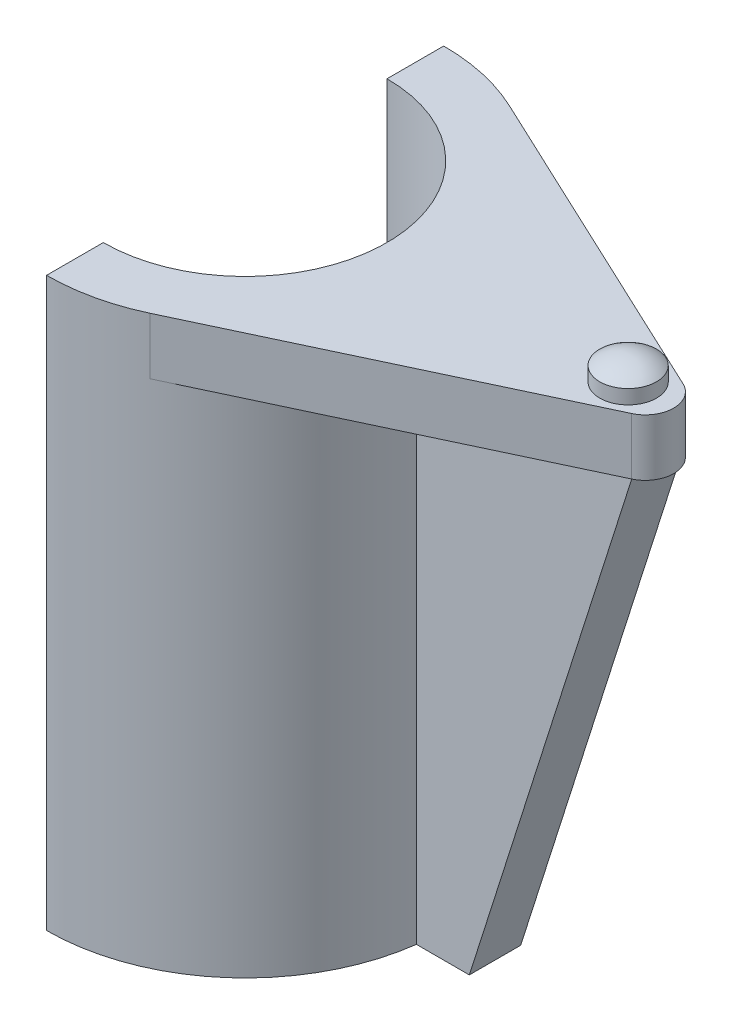
ISO-10303-21;
HEADER;
FILE_DESCRIPTION(('STEP AP214'),'2;1');
FILE_NAME('part.step','',(''),(''),'','','');
FILE_SCHEMA(('AUTOMOTIVE_DESIGN { 1 0 10303 214 1 1 1 1 }'));
ENDSEC;
DATA;
#1=APPLICATION_CONTEXT('core data for automotive mechanical design processes');
#2=APPLICATION_PROTOCOL_DEFINITION('international standard','automotive_design',2000,#1);
#3=PRODUCT_CONTEXT('',#1,'mechanical');
#4=PRODUCT('Part','Part','',(#3));
#5=PRODUCT_RELATED_PRODUCT_CATEGORY('part','',(#4));
#6=PRODUCT_DEFINITION_FORMATION('','',#4);
#7=PRODUCT_DEFINITION_CONTEXT('part definition',#1,'design');
#8=PRODUCT_DEFINITION('design','',#6,#7);
#9=PRODUCT_DEFINITION_SHAPE('','',#8);
#10=(LENGTH_UNIT() NAMED_UNIT(*) SI_UNIT(.MILLI.,.METRE.));
#11=(NAMED_UNIT(*) PLANE_ANGLE_UNIT() SI_UNIT($,.RADIAN.));
#12=(NAMED_UNIT(*) SI_UNIT($,.STERADIAN.) SOLID_ANGLE_UNIT());
#13=UNCERTAINTY_MEASURE_WITH_UNIT(LENGTH_MEASURE(1.E-05),#10,'distance_accuracy_value','');
#14=(GEOMETRIC_REPRESENTATION_CONTEXT(3) GLOBAL_UNCERTAINTY_ASSIGNED_CONTEXT((#13)) GLOBAL_UNIT_ASSIGNED_CONTEXT((#10,
#11,#12)) REPRESENTATION_CONTEXT('',''));
#15=CARTESIAN_POINT('',(0.,0.,0.));
#16=DIRECTION('',(0.,0.,1.));
#17=DIRECTION('',(1.,0.,0.));
#18=AXIS2_PLACEMENT_3D('',#15,#16,#17);
#19=CARTESIAN_POINT('',(0.,-400.,0.));
#20=DIRECTION('',(0.,1.,0.));
#21=DIRECTION('',(0.,0.,1.));
#22=AXIS2_PLACEMENT_3D('',#19,#20,#21);
#23=CYLINDRICAL_SURFACE('',#22,140.);
#24=DIRECTION('',(0.,1.,0.));
#25=VECTOR('',#24,1.);
#26=CARTESIAN_POINT('',(138.824954970404,-400.,18.100604339779));
#27=LINE('',#26,#25);
#28=CARTESIAN_POINT('',(138.824954970404,-40.,18.100604339779));
#29=VERTEX_POINT('',#28);
#30=CARTESIAN_POINT('',(138.824954970404,-400.,18.100604339779));
#31=VERTEX_POINT('',#30);
#32=EDGE_CURVE('E169',#29,#31,#27,.F.);
#33=ORIENTED_EDGE('',*,*,#32,.F.);
#34=CARTESIAN_POINT('',(0.,-40.,0.));
#35=DIRECTION('',(0.,1.,0.));
#36=DIRECTION('',(0.,0.,1.));
#37=AXIS2_PLACEMENT_3D('',#34,#35,#36);
#38=CIRCLE('',#37,140.);
#39=CARTESIAN_POINT('',(59.5486188270065,-40.,126.704230378452));
#40=VERTEX_POINT('',#39);
#41=EDGE_CURVE('E148',#29,#40,#38,.F.);
#42=ORIENTED_EDGE('',*,*,#41,.T.);
#43=DIRECTION('',(0.,1.,0.));
#44=VECTOR('',#43,1.);
#45=CARTESIAN_POINT('',(59.5486188270065,-40.,126.704230378452));
#46=LINE('',#45,#44);
#47=CARTESIAN_POINT('',(59.5486188270065,0.,126.704230378452));
#48=VERTEX_POINT('',#47);
#49=EDGE_CURVE('E158',#40,#48,#46,.T.);
#50=ORIENTED_EDGE('',*,*,#49,.T.);
#51=CARTESIAN_POINT('',(0.,0.,0.));
#52=DIRECTION('',(0.,1.,0.));
#53=DIRECTION('',(0.,0.,1.));
#54=AXIS2_PLACEMENT_3D('',#51,#52,#53);
#55=CIRCLE('',#54,140.);
#56=CARTESIAN_POINT('',(0.,0.,140.));
#57=VERTEX_POINT('',#56);
#58=EDGE_CURVE('E203',#57,#48,#55,.T.);
#59=ORIENTED_EDGE('',*,*,#58,.F.);
#60=DIRECTION('',(0.,1.,0.));
#61=VECTOR('',#60,1.);
#62=CARTESIAN_POINT('',(0.,-400.,140.));
#63=LINE('',#62,#61);
#64=CARTESIAN_POINT('',(0.,-400.,140.));
#65=VERTEX_POINT('',#64);
#66=EDGE_CURVE('E211',#65,#57,#63,.T.);
#67=ORIENTED_EDGE('',*,*,#66,.F.);
#68=CARTESIAN_POINT('',(0.,-400.,0.));
#69=DIRECTION('',(0.,1.,0.));
#70=DIRECTION('',(0.,0.,1.));
#71=AXIS2_PLACEMENT_3D('',#68,#69,#70);
#72=CIRCLE('',#71,140.);
#73=EDGE_CURVE('E190',#65,#31,#72,.T.);
#74=ORIENTED_EDGE('',*,*,#73,.T.);
#75=EDGE_LOOP('',(#33,#42,#50,#59,#67,#74));
#76=FACE_BOUND('',#75,.T.);
#77=ADVANCED_FACE('F34',(#76),#23,.T.);
#78=CARTESIAN_POINT('',(0.,-40.,0.));
#79=DIRECTION('',(0.,1.,0.));
#80=DIRECTION('',(0.,0.,1.));
#81=AXIS2_PLACEMENT_3D('',#78,#79,#80);
#82=PLANE('',#81);
#83=ORIENTED_EDGE('',*,*,#41,.F.);
#84=DIRECTION('',(1.,0.,0.));
#85=VECTOR('',#84,1.);
#86=CARTESIAN_POINT('',(0.,-40.,18.100604339779));
#87=LINE('',#86,#85);
#88=CARTESIAN_POINT('',(290.629357970844,-40.,18.100604339779));
#89=VERTEX_POINT('',#88);
#90=EDGE_CURVE('E42',#29,#89,#87,.T.);
#91=ORIENTED_EDGE('',*,*,#90,.T.);
#92=DIRECTION('',(0.905030216988944,0.,-0.425347277335761));
#93=VECTOR('',#92,1.);
#94=CARTESIAN_POINT('',(59.5486188270065,-40.,126.704230378452));
#95=LINE('',#94,#93);
#96=EDGE_CURVE('E147',#40,#89,#95,.T.);
#97=ORIENTED_EDGE('',*,*,#96,.F.);
#98=EDGE_LOOP('',(#83,#91,#97));
#99=FACE_BOUND('',#98,.T.);
#100=ADVANCED_FACE('F145',(#99),#82,.F.);
#101=CARTESIAN_POINT('',(0.,-400.,0.));
#102=DIRECTION('',(0.,1.,0.));
#103=DIRECTION('',(0.,0.,1.));
#104=AXIS2_PLACEMENT_3D('',#101,#102,#103);
#105=CYLINDRICAL_SURFACE('',#104,100.);
#106=CARTESIAN_POINT('',(0.,-400.,0.));
#107=DIRECTION('',(0.,-1.,0.));
#108=DIRECTION('',(0.,0.,1.));
#109=AXIS2_PLACEMENT_3D('',#106,#107,#108);
#110=CIRCLE('',#109,100.);
#111=CARTESIAN_POINT('',(0.,-400.,-100.));
#112=VERTEX_POINT('',#111);
#113=CARTESIAN_POINT('',(0.,-400.,100.));
#114=VERTEX_POINT('',#113);
#115=EDGE_CURVE('E183',#112,#114,#110,.T.);
#116=ORIENTED_EDGE('',*,*,#115,.T.);
#117=DIRECTION('',(0.,1.,0.));
#118=VECTOR('',#117,1.);
#119=CARTESIAN_POINT('',(0.,-400.,100.));
#120=LINE('',#119,#118);
#121=CARTESIAN_POINT('',(0.,0.,100.));
#122=VERTEX_POINT('',#121);
#123=EDGE_CURVE('E196',#114,#122,#120,.T.);
#124=ORIENTED_EDGE('',*,*,#123,.T.);
#125=CARTESIAN_POINT('',(0.,0.,0.));
#126=DIRECTION('',(0.,-1.,0.));
#127=DIRECTION('',(0.,0.,1.));
#128=AXIS2_PLACEMENT_3D('',#125,#126,#127);
#129=CIRCLE('',#128,100.);
#130=CARTESIAN_POINT('',(0.,0.,-100.));
#131=VERTEX_POINT('',#130);
#132=EDGE_CURVE('E182',#131,#122,#129,.T.);
#133=ORIENTED_EDGE('',*,*,#132,.F.);
#134=DIRECTION('',(0.,1.,0.));
#135=VECTOR('',#134,1.);
#136=CARTESIAN_POINT('',(0.,-400.,-100.));
#137=LINE('',#136,#135);
#138=EDGE_CURVE('E149',#112,#131,#137,.T.);
#139=ORIENTED_EDGE('',*,*,#138,.F.);
#140=EDGE_LOOP('',(#116,#124,#133,#139));
#141=FACE_BOUND('',#140,.T.);
#142=ADVANCED_FACE('F257',(#141),#105,.F.);
#143=CARTESIAN_POINT('',(0.,-400.,-140.));
#144=DIRECTION('',(-1.,0.,0.));
#145=DIRECTION('',(0.,0.,1.));
#146=AXIS2_PLACEMENT_3D('',#143,#144,#145);
#147=PLANE('',#146);
#148=CARTESIAN_POINT('',(0.,-350.,-120.));
#149=DIRECTION('',(-1.,0.,0.));
#150=DIRECTION('',(0.,0.,-1.));
#151=AXIS2_PLACEMENT_3D('',#148,#149,#150);
#152=CIRCLE('',#151,8.00000000000003);
#153=CARTESIAN_POINT('',(0.,-350.,-128.));
#154=VERTEX_POINT('',#153);
#155=EDGE_CURVE('E331',#154,#154,#152,.T.);
#156=ORIENTED_EDGE('',*,*,#155,.F.);
#157=EDGE_LOOP('',(#156));
#158=FACE_BOUND('',#157,.T.);
#159=CARTESIAN_POINT('',(0.,-290.,-120.));
#160=DIRECTION('',(-1.,0.,0.));
#161=DIRECTION('',(0.,0.,-1.));
#162=AXIS2_PLACEMENT_3D('',#159,#160,#161);
#163=CIRCLE('',#162,8.);
#164=CARTESIAN_POINT('',(0.,-290.,-128.));
#165=VERTEX_POINT('',#164);
#166=EDGE_CURVE('E337',#165,#165,#163,.T.);
#167=ORIENTED_EDGE('',*,*,#166,.F.);
#168=EDGE_LOOP('',(#167));
#169=FACE_BOUND('',#168,.T.);
#170=CARTESIAN_POINT('',(0.,-230.,-120.));
#171=DIRECTION('',(-1.,0.,0.));
#172=DIRECTION('',(0.,0.,-1.));
#173=AXIS2_PLACEMENT_3D('',#170,#171,#172);
#174=CIRCLE('',#173,8.);
#175=CARTESIAN_POINT('',(0.,-230.,-128.));
#176=VERTEX_POINT('',#175);
#177=EDGE_CURVE('E343',#176,#176,#174,.T.);
#178=ORIENTED_EDGE('',*,*,#177,.F.);
#179=EDGE_LOOP('',(#178));
#180=FACE_BOUND('',#179,.T.);
#181=CARTESIAN_POINT('',(0.,-170.,-120.));
#182=DIRECTION('',(-1.,0.,0.));
#183=DIRECTION('',(0.,0.,-1.));
#184=AXIS2_PLACEMENT_3D('',#181,#182,#183);
#185=CIRCLE('',#184,8.);
#186=CARTESIAN_POINT('',(0.,-170.,-128.));
#187=VERTEX_POINT('',#186);
#188=EDGE_CURVE('E349',#187,#187,#185,.T.);
#189=ORIENTED_EDGE('',*,*,#188,.F.);
#190=EDGE_LOOP('',(#189));
#191=FACE_BOUND('',#190,.T.);
#192=CARTESIAN_POINT('',(0.,-110.,-120.));
#193=DIRECTION('',(-1.,0.,0.));
#194=DIRECTION('',(0.,0.,-1.));
#195=AXIS2_PLACEMENT_3D('',#192,#193,#194);
#196=CIRCLE('',#195,8.00000000000003);
#197=CARTESIAN_POINT('',(0.,-110.,-128.));
#198=VERTEX_POINT('',#197);
#199=EDGE_CURVE('E355',#198,#198,#196,.T.);
#200=ORIENTED_EDGE('',*,*,#199,.F.);
#201=EDGE_LOOP('',(#200));
#202=FACE_BOUND('',#201,.T.);
#203=CARTESIAN_POINT('',(0.,-50.,-120.));
#204=DIRECTION('',(-1.,0.,0.));
#205=DIRECTION('',(0.,0.,-1.));
#206=AXIS2_PLACEMENT_3D('',#203,#204,#205);
#207=CIRCLE('',#206,7.99999999999998);
#208=CARTESIAN_POINT('',(0.,-50.,-128.));
#209=VERTEX_POINT('',#208);
#210=EDGE_CURVE('E128',#209,#209,#207,.T.);
#211=ORIENTED_EDGE('',*,*,#210,.F.);
#212=EDGE_LOOP('',(#211));
#213=FACE_BOUND('',#212,.T.);
#214=DIRECTION('',(0.,0.,1.));
#215=VECTOR('',#214,1.);
#216=CARTESIAN_POINT('',(0.,0.,-140.));
#217=LINE('',#216,#215);
#218=CARTESIAN_POINT('',(0.,0.,-140.));
#219=VERTEX_POINT('',#218);
#220=EDGE_CURVE('E186',#219,#131,#217,.T.);
#221=ORIENTED_EDGE('',*,*,#220,.F.);
#222=DIRECTION('',(0.,1.,0.));
#223=VECTOR('',#222,1.);
#224=CARTESIAN_POINT('',(0.,-400.,-140.));
#225=LINE('',#224,#223);
#226=CARTESIAN_POINT('',(0.,-400.,-140.));
#227=VERTEX_POINT('',#226);
#228=EDGE_CURVE('E209',#227,#219,#225,.T.);
#229=ORIENTED_EDGE('',*,*,#228,.F.);
#230=DIRECTION('',(0.,0.,1.));
#231=VECTOR('',#230,1.);
#232=CARTESIAN_POINT('',(0.,-400.,-140.));
#233=LINE('',#232,#231);
#234=EDGE_CURVE('E193',#227,#112,#233,.T.);
#235=ORIENTED_EDGE('',*,*,#234,.T.);
#236=ORIENTED_EDGE('',*,*,#138,.T.);
#237=EDGE_LOOP('',(#221,#229,#235,#236));
#238=FACE_BOUND('',#237,.T.);
#239=ADVANCED_FACE('F250',(#158,#169,#180,#191,#202,#213,#238),#147,.T.);
#240=DIRECTION('',(0.,1.,0.));
#241=VECTOR('',#240,1.);
#242=CARTESIAN_POINT('',(138.824954970404,-400.,-18.100604339779));
#243=LINE('',#242,#241);
#244=CARTESIAN_POINT('',(138.824954970404,-400.,-18.100604339779));
#245=VERTEX_POINT('',#244);
#246=CARTESIAN_POINT('',(138.824954970404,-40.,-18.100604339779));
#247=VERTEX_POINT('',#246);
#248=EDGE_CURVE('E49',#245,#247,#243,.T.);
#249=ORIENTED_EDGE('',*,*,#248,.F.);
#250=EDGE_CURVE('E189',#245,#227,#72,.T.);
#251=ORIENTED_EDGE('',*,*,#250,.T.);
#252=ORIENTED_EDGE('',*,*,#228,.T.);
#253=CARTESIAN_POINT('',(59.5486188270065,0.,-126.704230378452));
#254=VERTEX_POINT('',#253);
#255=EDGE_CURVE('E202',#254,#219,#55,.T.);
#256=ORIENTED_EDGE('',*,*,#255,.F.);
#257=DIRECTION('',(0.,1.,0.));
#258=VECTOR('',#257,1.);
#259=CARTESIAN_POINT('',(59.5486188270065,-40.,-126.704230378452));
#260=LINE('',#259,#258);
#261=CARTESIAN_POINT('',(59.5486188270065,-40.,-126.704230378452));
#262=VERTEX_POINT('',#261);
#263=EDGE_CURVE('E175',#262,#254,#260,.T.);
#264=ORIENTED_EDGE('',*,*,#263,.F.);
#265=EDGE_CURVE('E179',#262,#247,#38,.F.);
#266=ORIENTED_EDGE('',*,*,#265,.T.);
#267=EDGE_LOOP('',(#249,#251,#252,#256,#264,#266));
#268=FACE_BOUND('',#267,.T.);
#269=ADVANCED_FACE('F254',(#268),#23,.T.);
#270=CARTESIAN_POINT('',(0.,-400.,100.));
#271=DIRECTION('',(-1.,0.,0.));
#272=DIRECTION('',(0.,0.,1.));
#273=AXIS2_PLACEMENT_3D('',#270,#271,#272);
#274=PLANE('',#273);
#275=CARTESIAN_POINT('',(0.,-110.,120.));
#276=DIRECTION('',(-1.,0.,0.));
#277=DIRECTION('',(0.,0.,1.));
#278=AXIS2_PLACEMENT_3D('',#275,#276,#277);
#279=CIRCLE('',#278,8.00000000000003);
#280=CARTESIAN_POINT('',(0.,-110.,128.));
#281=VERTEX_POINT('',#280);
#282=EDGE_CURVE('E284',#281,#281,#279,.T.);
#283=ORIENTED_EDGE('',*,*,#282,.F.);
#284=EDGE_LOOP('',(#283));
#285=FACE_BOUND('',#284,.T.);
#286=CARTESIAN_POINT('',(0.,-170.,120.));
#287=DIRECTION('',(-1.,0.,0.));
#288=DIRECTION('',(0.,0.,1.));
#289=AXIS2_PLACEMENT_3D('',#286,#287,#288);
#290=CIRCLE('',#289,8.);
#291=CARTESIAN_POINT('',(0.,-170.,128.));
#292=VERTEX_POINT('',#291);
#293=EDGE_CURVE('E288',#292,#292,#290,.T.);
#294=ORIENTED_EDGE('',*,*,#293,.F.);
#295=EDGE_LOOP('',(#294));
#296=FACE_BOUND('',#295,.T.);
#297=CARTESIAN_POINT('',(0.,-230.,120.));
#298=DIRECTION('',(-1.,0.,0.));
#299=DIRECTION('',(0.,0.,1.));
#300=AXIS2_PLACEMENT_3D('',#297,#298,#299);
#301=CIRCLE('',#300,8.);
#302=CARTESIAN_POINT('',(0.,-230.,128.));
#303=VERTEX_POINT('',#302);
#304=EDGE_CURVE('E292',#303,#303,#301,.T.);
#305=ORIENTED_EDGE('',*,*,#304,.F.);
#306=EDGE_LOOP('',(#305));
#307=FACE_BOUND('',#306,.T.);
#308=CARTESIAN_POINT('',(0.,-290.,120.));
#309=DIRECTION('',(-1.,0.,0.));
#310=DIRECTION('',(0.,0.,1.));
#311=AXIS2_PLACEMENT_3D('',#308,#309,#310);
#312=CIRCLE('',#311,8.);
#313=CARTESIAN_POINT('',(0.,-290.,128.));
#314=VERTEX_POINT('',#313);
#315=EDGE_CURVE('E296',#314,#314,#312,.T.);
#316=ORIENTED_EDGE('',*,*,#315,.F.);
#317=EDGE_LOOP('',(#316));
#318=FACE_BOUND('',#317,.T.);
#319=CARTESIAN_POINT('',(0.,-350.,120.));
#320=DIRECTION('',(-1.,0.,0.));
#321=DIRECTION('',(0.,0.,1.));
#322=AXIS2_PLACEMENT_3D('',#319,#320,#321);
#323=CIRCLE('',#322,8.00000000000003);
#324=CARTESIAN_POINT('',(0.,-350.,128.));
#325=VERTEX_POINT('',#324);
#326=EDGE_CURVE('E300',#325,#325,#323,.T.);
#327=ORIENTED_EDGE('',*,*,#326,.F.);
#328=EDGE_LOOP('',(#327));
#329=FACE_BOUND('',#328,.T.);
#330=CARTESIAN_POINT('',(0.,-50.,120.));
#331=DIRECTION('',(-1.,0.,0.));
#332=DIRECTION('',(0.,0.,1.));
#333=AXIS2_PLACEMENT_3D('',#330,#331,#332);
#334=CIRCLE('',#333,7.99999999999998);
#335=CARTESIAN_POINT('',(0.,-50.,128.));
#336=VERTEX_POINT('',#335);
#337=EDGE_CURVE('E227',#336,#336,#334,.T.);
#338=ORIENTED_EDGE('',*,*,#337,.F.);
#339=EDGE_LOOP('',(#338));
#340=FACE_BOUND('',#339,.T.);
#341=DIRECTION('',(0.,0.,1.));
#342=VECTOR('',#341,1.);
#343=CARTESIAN_POINT('',(0.,0.,100.));
#344=LINE('',#343,#342);
#345=EDGE_CURVE('E199',#122,#57,#344,.T.);
#346=ORIENTED_EDGE('',*,*,#345,.F.);
#347=ORIENTED_EDGE('',*,*,#123,.F.);
#348=DIRECTION('',(0.,0.,1.));
#349=VECTOR('',#348,1.);
#350=CARTESIAN_POINT('',(0.,-400.,100.));
#351=LINE('',#350,#349);
#352=EDGE_CURVE('E185',#114,#65,#351,.T.);
#353=ORIENTED_EDGE('',*,*,#352,.T.);
#354=ORIENTED_EDGE('',*,*,#66,.T.);
#355=EDGE_LOOP('',(#346,#347,#353,#354));
#356=FACE_BOUND('',#355,.T.);
#357=ADVANCED_FACE('F241',(#285,#296,#307,#318,#329,#340,#356),#274,.T.);
#358=CARTESIAN_POINT('',(0.,-400.,0.));
#359=DIRECTION('',(0.,1.,0.));
#360=DIRECTION('',(0.,0.,1.));
#361=AXIS2_PLACEMENT_3D('',#358,#359,#360);
#362=PLANE('',#361);
#363=DIRECTION('',(-1.,0.,0.));
#364=VECTOR('',#363,1.);
#365=CARTESIAN_POINT('',(290.629357970844,-400.,-18.100604339779));
#366=LINE('',#365,#364);
#367=CARTESIAN_POINT('',(176.145834141605,-400.,-18.1006043397791));
#368=VERTEX_POINT('',#367);
#369=EDGE_CURVE('E219',#368,#245,#366,.T.);
#370=ORIENTED_EDGE('',*,*,#369,.F.);
#371=DIRECTION('',(0.,0.,1.));
#372=VECTOR('',#371,1.);
#373=CARTESIAN_POINT('',(176.145834141605,-400.,-151.899395660221));
#374=LINE('',#373,#372);
#375=CARTESIAN_POINT('',(176.145834141605,-400.,18.100604339779));
#376=VERTEX_POINT('',#375);
#377=EDGE_CURVE('E137',#368,#376,#374,.T.);
#378=ORIENTED_EDGE('',*,*,#377,.T.);
#379=DIRECTION('',(1.,0.,0.));
#380=VECTOR('',#379,1.);
#381=CARTESIAN_POINT('',(290.629357970844,-400.,18.1006043397791));
#382=LINE('',#381,#380);
#383=EDGE_CURVE('E136',#31,#376,#382,.T.);
#384=ORIENTED_EDGE('',*,*,#383,.F.);
#385=ORIENTED_EDGE('',*,*,#73,.F.);
#386=ORIENTED_EDGE('',*,*,#352,.F.);
#387=ORIENTED_EDGE('',*,*,#115,.F.);
#388=ORIENTED_EDGE('',*,*,#234,.F.);
#389=ORIENTED_EDGE('',*,*,#250,.F.);
#390=EDGE_LOOP('',(#370,#378,#384,#385,#386,#387,#388,#389));
#391=FACE_BOUND('',#390,.T.);
#392=ADVANCED_FACE('F236',(#391),#362,.F.);
#393=CARTESIAN_POINT('',(0.,0.,0.));
#394=DIRECTION('',(0.,1.,0.));
#395=DIRECTION('',(0.,0.,1.));
#396=AXIS2_PLACEMENT_3D('',#393,#394,#395);
#397=PLANE('',#396);
#398=CARTESIAN_POINT('',(270.,0.,0.));
#399=DIRECTION('',(0.,1.,0.));
#400=DIRECTION('',(0.,0.,1.));
#401=AXIS2_PLACEMENT_3D('',#398,#399,#400);
#402=CIRCLE('',#401,20.);
#403=CARTESIAN_POINT('',(270.,0.,20.));
#404=VERTEX_POINT('',#403);
#405=EDGE_CURVE('E216',#404,#404,#402,.T.);
#406=ORIENTED_EDGE('',*,*,#405,.F.);
#407=EDGE_LOOP('',(#406));
#408=FACE_BOUND('',#407,.T.);
#409=ORIENTED_EDGE('',*,*,#132,.T.);
#410=ORIENTED_EDGE('',*,*,#345,.T.);
#411=ORIENTED_EDGE('',*,*,#58,.T.);
#412=DIRECTION('',(0.905030216988944,0.,-0.425347277335761));
#413=VECTOR('',#412,1.);
#414=CARTESIAN_POINT('',(59.5486188270065,0.,126.704230378452));
#415=LINE('',#414,#413);
#416=CARTESIAN_POINT('',(290.629357970844,0.,18.100604339779));
#417=VERTEX_POINT('',#416);
#418=EDGE_CURVE('E172',#48,#417,#415,.T.);
#419=ORIENTED_EDGE('',*,*,#418,.T.);
#420=CARTESIAN_POINT('',(282.122412424129,0.,0.));
#421=DIRECTION('',(0.,1.,0.));
#422=DIRECTION('',(0.,0.,1.));
#423=AXIS2_PLACEMENT_3D('',#420,#421,#422);
#424=CIRCLE('',#423,20.);
#425=CARTESIAN_POINT('',(290.629357970844,0.,-18.100604339779));
#426=VERTEX_POINT('',#425);
#427=EDGE_CURVE('E154',#417,#426,#424,.T.);
#428=ORIENTED_EDGE('',*,*,#427,.T.);
#429=DIRECTION('',(-0.905030216988944,0.,-0.425347277335761));
#430=VECTOR('',#429,1.);
#431=CARTESIAN_POINT('',(59.5486188270065,0.,-126.704230378452));
#432=LINE('',#431,#430);
#433=EDGE_CURVE('E57',#426,#254,#432,.T.);
#434=ORIENTED_EDGE('',*,*,#433,.T.);
#435=ORIENTED_EDGE('',*,*,#255,.T.);
#436=ORIENTED_EDGE('',*,*,#220,.T.);
#437=EDGE_LOOP('',(#409,#410,#411,#419,#428,#434,#435,#436));
#438=FACE_BOUND('',#437,.T.);
#439=ADVANCED_FACE('F256',(#408,#438),#397,.T.);
#440=CARTESIAN_POINT('',(59.5486188270065,-40.,-126.704230378452));
#441=DIRECTION('',(0.425347277335761,0.,-0.905030216988944));
#442=DIRECTION('',(-0.905030216988944,0.,-0.425347277335761));
#443=AXIS2_PLACEMENT_3D('',#440,#441,#442);
#444=PLANE('',#443);
#445=ORIENTED_EDGE('',*,*,#433,.F.);
#446=DIRECTION('',(0.,1.,0.));
#447=VECTOR('',#446,1.);
#448=CARTESIAN_POINT('',(290.629357970844,-40.,-18.100604339779));
#449=LINE('',#448,#447);
#450=CARTESIAN_POINT('',(290.629357970844,-40.,-18.1006043397791));
#451=VERTEX_POINT('',#450);
#452=EDGE_CURVE('E157',#451,#426,#449,.T.);
#453=ORIENTED_EDGE('',*,*,#452,.F.);
#454=DIRECTION('',(-0.905030216988944,0.,-0.425347277335761));
#455=VECTOR('',#454,1.);
#456=CARTESIAN_POINT('',(59.5486188270065,-40.,-126.704230378452));
#457=LINE('',#456,#455);
#458=EDGE_CURVE('E163',#451,#262,#457,.T.);
#459=ORIENTED_EDGE('',*,*,#458,.T.);
#460=ORIENTED_EDGE('',*,*,#263,.T.);
#461=EDGE_LOOP('',(#445,#453,#459,#460));
#462=FACE_BOUND('',#461,.T.);
#463=ADVANCED_FACE('F403',(#462),#444,.T.);
#464=CARTESIAN_POINT('',(282.122412424129,-40.,0.));
#465=DIRECTION('',(0.,1.,0.));
#466=DIRECTION('',(0.,0.,1.));
#467=AXIS2_PLACEMENT_3D('',#464,#465,#466);
#468=CYLINDRICAL_SURFACE('',#467,20.);
#469=CARTESIAN_POINT('',(282.122412424129,-40.,0.));
#470=DIRECTION('',(0.,1.,0.));
#471=DIRECTION('',(-1.,0.,0.));
#472=AXIS2_PLACEMENT_3D('',#469,#470,#471);
#473=CIRCLE('',#472,20.);
#474=EDGE_CURVE('E11',#451,#89,#473,.F.);
#475=ORIENTED_EDGE('',*,*,#474,.F.);
#476=ORIENTED_EDGE('',*,*,#452,.T.);
#477=ORIENTED_EDGE('',*,*,#427,.F.);
#478=DIRECTION('',(0.,1.,0.));
#479=VECTOR('',#478,1.);
#480=CARTESIAN_POINT('',(290.629357970844,-40.,18.100604339779));
#481=LINE('',#480,#479);
#482=EDGE_CURVE('E152',#89,#417,#481,.T.);
#483=ORIENTED_EDGE('',*,*,#482,.F.);
#484=EDGE_LOOP('',(#475,#476,#477,#483));
#485=FACE_BOUND('',#484,.T.);
#486=ADVANCED_FACE('F153',(#485),#468,.T.);
#487=CARTESIAN_POINT('',(59.5486188270065,-40.,126.704230378452));
#488=DIRECTION('',(0.425347277335761,0.,0.905030216988944));
#489=DIRECTION('',(0.905030216988944,0.,-0.425347277335761));
#490=AXIS2_PLACEMENT_3D('',#487,#488,#489);
#491=PLANE('',#490);
#492=ORIENTED_EDGE('',*,*,#418,.F.);
#493=ORIENTED_EDGE('',*,*,#49,.F.);
#494=ORIENTED_EDGE('',*,*,#96,.T.);
#495=ORIENTED_EDGE('',*,*,#482,.T.);
#496=EDGE_LOOP('',(#492,#493,#494,#495));
#497=FACE_BOUND('',#496,.T.);
#498=ADVANCED_FACE('F161',(#497),#491,.T.);
#499=ORIENTED_EDGE('',*,*,#458,.F.);
#500=DIRECTION('',(-1.,0.,0.));
#501=VECTOR('',#500,1.);
#502=CARTESIAN_POINT('',(290.629357970844,-40.,-18.100604339779));
#503=LINE('',#502,#501);
#504=EDGE_CURVE('E215',#451,#247,#503,.T.);
#505=ORIENTED_EDGE('',*,*,#504,.T.);
#506=ORIENTED_EDGE('',*,*,#265,.F.);
#507=EDGE_LOOP('',(#499,#505,#506));
#508=FACE_BOUND('',#507,.T.);
#509=ADVANCED_FACE('F266',(#508),#82,.F.);
#510=CARTESIAN_POINT('',(290.629357970844,-400.,18.1006043397791));
#511=DIRECTION('',(0.,0.,1.));
#512=DIRECTION('',(1.,0.,0.));
#513=AXIS2_PLACEMENT_3D('',#510,#511,#512);
#514=PLANE('',#513);
#515=DIRECTION('',(-0.303054785214158,-0.952973135591345,0.));
#516=VECTOR('',#515,1.);
#517=CARTESIAN_POINT('',(290.629357970844,-40.,18.100604339779));
#518=LINE('',#517,#516);
#519=EDGE_CURVE('E122',#89,#376,#518,.T.);
#520=ORIENTED_EDGE('',*,*,#519,.F.);
#521=ORIENTED_EDGE('',*,*,#90,.F.);
#522=ORIENTED_EDGE('',*,*,#32,.T.);
#523=ORIENTED_EDGE('',*,*,#383,.T.);
#524=EDGE_LOOP('',(#520,#521,#522,#523));
#525=FACE_BOUND('',#524,.T.);
#526=ADVANCED_FACE('F132',(#525),#514,.T.);
#527=CARTESIAN_POINT('',(290.629357970844,-400.,-18.100604339779));
#528=DIRECTION('',(0.,0.,-1.));
#529=DIRECTION('',(-1.,0.,0.));
#530=AXIS2_PLACEMENT_3D('',#527,#528,#529);
#531=PLANE('',#530);
#532=DIRECTION('',(0.303054785214158,0.952973135591345,0.));
#533=VECTOR('',#532,1.);
#534=CARTESIAN_POINT('',(186.660253159105,-366.936806977168,-18.100604339779));
#535=LINE('',#534,#533);
#536=EDGE_CURVE('E125',#368,#451,#535,.T.);
#537=ORIENTED_EDGE('',*,*,#536,.F.);
#538=ORIENTED_EDGE('',*,*,#369,.T.);
#539=ORIENTED_EDGE('',*,*,#248,.T.);
#540=ORIENTED_EDGE('',*,*,#504,.F.);
#541=EDGE_LOOP('',(#537,#538,#539,#540));
#542=FACE_BOUND('',#541,.T.);
#543=ADVANCED_FACE('F395',(#542),#531,.T.);
#544=CARTESIAN_POINT('',(270.,10.,0.));
#545=DIRECTION('',(0.,-1.,0.));
#546=DIRECTION('',(0.,0.,-1.));
#547=AXIS2_PLACEMENT_3D('',#544,#545,#546);
#548=CYLINDRICAL_SURFACE('',#547,20.);
#549=CARTESIAN_POINT('',(270.,10.,0.));
#550=DIRECTION('',(0.,1.,0.));
#551=DIRECTION('',(0.,0.,1.));
#552=AXIS2_PLACEMENT_3D('',#549,#550,#551);
#553=CIRCLE('',#552,20.);
#554=CARTESIAN_POINT('',(270.,10.,20.));
#555=VERTEX_POINT('',#554);
#556=EDGE_CURVE('E213',#555,#555,#553,.T.);
#557=ORIENTED_EDGE('',*,*,#556,.F.);
#558=EDGE_LOOP('',(#557));
#559=FACE_BOUND('',#558,.T.);
#560=ORIENTED_EDGE('',*,*,#405,.T.);
#561=EDGE_LOOP('',(#560));
#562=FACE_BOUND('',#561,.T.);
#563=ADVANCED_FACE('F392',(#559,#562),#548,.T.);
#564=CARTESIAN_POINT('',(270.,-15.0714285714286,0.));
#565=DIRECTION('',(0.,0.,1.));
#566=DIRECTION('',(1.,0.,0.));
#567=AXIS2_PLACEMENT_3D('',#564,#565,#566);
#568=SPHERICAL_SURFACE('',#567,32.0714285714286);
#569=CARTESIAN_POINT('',(270.,-15.0714285714286,0.));
#570=DIRECTION('',(0.,1.,0.));
#571=DIRECTION('',(0.,0.,1.));
#572=AXIS2_PLACEMENT_3D('',#569,#570,#571);
#573=SPHERICAL_SURFACE('',#572,32.0714285714286);
#574=ORIENTED_EDGE('',*,*,#556,.T.);
#575=EDGE_LOOP('',(#574));
#576=FACE_BOUND('',#575,.T.);
#577=ADVANCED_FACE('F36',(#576),#573,.T.);
#578=CARTESIAN_POINT('',(50.,-50.,120.));
#579=DIRECTION('',(-1.,0.,0.));
#580=DIRECTION('',(0.,0.,1.));
#581=AXIS2_PLACEMENT_3D('',#578,#579,#580);
#582=CYLINDRICAL_SURFACE('',#581,7.99999999999998);
#583=CARTESIAN_POINT('',(50.,-50.,120.));
#584=DIRECTION('',(-1.,0.,0.));
#585=DIRECTION('',(0.,0.,1.));
#586=AXIS2_PLACEMENT_3D('',#583,#584,#585);
#587=CIRCLE('',#586,7.99999999999998);
#588=CARTESIAN_POINT('',(50.,-50.,128.));
#589=VERTEX_POINT('',#588);
#590=EDGE_CURVE('E222',#589,#589,#587,.T.);
#591=ORIENTED_EDGE('',*,*,#590,.F.);
#592=EDGE_LOOP('',(#591));
#593=FACE_BOUND('',#592,.T.);
#594=ORIENTED_EDGE('',*,*,#337,.T.);
#595=EDGE_LOOP('',(#594));
#596=FACE_BOUND('',#595,.T.);
#597=ADVANCED_FACE('F387',(#593,#596),#582,.F.);
#598=CARTESIAN_POINT('',(50.,-50.,120.));
#599=DIRECTION('',(-1.,0.,0.));
#600=DIRECTION('',(0.,0.,1.));
#601=AXIS2_PLACEMENT_3D('',#598,#599,#600);
#602=PLANE('',#601);
#603=ORIENTED_EDGE('',*,*,#590,.T.);
#604=EDGE_LOOP('',(#603));
#605=FACE_BOUND('',#604,.T.);
#606=ADVANCED_FACE('F383',(#605),#602,.T.);
#607=CARTESIAN_POINT('',(50.,-350.,120.));
#608=DIRECTION('',(-1.,0.,0.));
#609=DIRECTION('',(0.,0.,1.));
#610=AXIS2_PLACEMENT_3D('',#607,#608,#609);
#611=CYLINDRICAL_SURFACE('',#610,8.00000000000003);
#612=CARTESIAN_POINT('',(50.,-350.,120.));
#613=DIRECTION('',(-1.,0.,0.));
#614=DIRECTION('',(0.,0.,1.));
#615=AXIS2_PLACEMENT_3D('',#612,#613,#614);
#616=CIRCLE('',#615,8.00000000000003);
#617=CARTESIAN_POINT('',(50.,-350.,128.));
#618=VERTEX_POINT('',#617);
#619=EDGE_CURVE('E324',#618,#618,#616,.T.);
#620=ORIENTED_EDGE('',*,*,#619,.F.);
#621=EDGE_LOOP('',(#620));
#622=FACE_BOUND('',#621,.T.);
#623=ORIENTED_EDGE('',*,*,#326,.T.);
#624=EDGE_LOOP('',(#623));
#625=FACE_BOUND('',#624,.T.);
#626=ADVANCED_FACE('F386',(#622,#625),#611,.F.);
#627=CARTESIAN_POINT('',(50.,-350.,120.));
#628=DIRECTION('',(-1.,0.,0.));
#629=DIRECTION('',(0.,0.,1.));
#630=AXIS2_PLACEMENT_3D('',#627,#628,#629);
#631=PLANE('',#630);
#632=ORIENTED_EDGE('',*,*,#619,.T.);
#633=EDGE_LOOP('',(#632));
#634=FACE_BOUND('',#633,.T.);
#635=ADVANCED_FACE('F465',(#634),#631,.T.);
#636=CARTESIAN_POINT('',(50.,-290.,120.));
#637=DIRECTION('',(-1.,0.,0.));
#638=DIRECTION('',(0.,0.,1.));
#639=AXIS2_PLACEMENT_3D('',#636,#637,#638);
#640=CYLINDRICAL_SURFACE('',#639,8.);
#641=CARTESIAN_POINT('',(50.,-290.,120.));
#642=DIRECTION('',(-1.,0.,0.));
#643=DIRECTION('',(0.,0.,1.));
#644=AXIS2_PLACEMENT_3D('',#641,#642,#643);
#645=CIRCLE('',#644,8.);
#646=CARTESIAN_POINT('',(50.,-290.,128.));
#647=VERTEX_POINT('',#646);
#648=EDGE_CURVE('E320',#647,#647,#645,.T.);
#649=ORIENTED_EDGE('',*,*,#648,.F.);
#650=EDGE_LOOP('',(#649));
#651=FACE_BOUND('',#650,.T.);
#652=ORIENTED_EDGE('',*,*,#315,.T.);
#653=EDGE_LOOP('',(#652));
#654=FACE_BOUND('',#653,.T.);
#655=ADVANCED_FACE('F473',(#651,#654),#640,.F.);
#656=CARTESIAN_POINT('',(50.,-290.,120.));
#657=DIRECTION('',(-1.,0.,0.));
#658=DIRECTION('',(0.,0.,1.));
#659=AXIS2_PLACEMENT_3D('',#656,#657,#658);
#660=PLANE('',#659);
#661=ORIENTED_EDGE('',*,*,#648,.T.);
#662=EDGE_LOOP('',(#661));
#663=FACE_BOUND('',#662,.T.);
#664=ADVANCED_FACE('F481',(#663),#660,.T.);
#665=CARTESIAN_POINT('',(50.,-230.,120.));
#666=DIRECTION('',(-1.,0.,0.));
#667=DIRECTION('',(0.,0.,1.));
#668=AXIS2_PLACEMENT_3D('',#665,#666,#667);
#669=CYLINDRICAL_SURFACE('',#668,8.);
#670=CARTESIAN_POINT('',(50.,-230.,120.));
#671=DIRECTION('',(-1.,0.,0.));
#672=DIRECTION('',(0.,0.,1.));
#673=AXIS2_PLACEMENT_3D('',#670,#671,#672);
#674=CIRCLE('',#673,8.);
#675=CARTESIAN_POINT('',(50.,-230.,128.));
#676=VERTEX_POINT('',#675);
#677=EDGE_CURVE('E316',#676,#676,#674,.T.);
#678=ORIENTED_EDGE('',*,*,#677,.F.);
#679=EDGE_LOOP('',(#678));
#680=FACE_BOUND('',#679,.T.);
#681=ORIENTED_EDGE('',*,*,#304,.T.);
#682=EDGE_LOOP('',(#681));
#683=FACE_BOUND('',#682,.T.);
#684=ADVANCED_FACE('F489',(#680,#683),#669,.F.);
#685=CARTESIAN_POINT('',(50.,-230.,120.));
#686=DIRECTION('',(-1.,0.,0.));
#687=DIRECTION('',(0.,0.,1.));
#688=AXIS2_PLACEMENT_3D('',#685,#686,#687);
#689=PLANE('',#688);
#690=ORIENTED_EDGE('',*,*,#677,.T.);
#691=EDGE_LOOP('',(#690));
#692=FACE_BOUND('',#691,.T.);
#693=ADVANCED_FACE('F497',(#692),#689,.T.);
#694=CARTESIAN_POINT('',(50.,-170.,120.));
#695=DIRECTION('',(-1.,0.,0.));
#696=DIRECTION('',(0.,0.,1.));
#697=AXIS2_PLACEMENT_3D('',#694,#695,#696);
#698=CYLINDRICAL_SURFACE('',#697,8.);
#699=CARTESIAN_POINT('',(50.,-170.,120.));
#700=DIRECTION('',(-1.,0.,0.));
#701=DIRECTION('',(0.,0.,1.));
#702=AXIS2_PLACEMENT_3D('',#699,#700,#701);
#703=CIRCLE('',#702,8.);
#704=CARTESIAN_POINT('',(50.,-170.,128.));
#705=VERTEX_POINT('',#704);
#706=EDGE_CURVE('E309',#705,#705,#703,.T.);
#707=ORIENTED_EDGE('',*,*,#706,.F.);
#708=EDGE_LOOP('',(#707));
#709=FACE_BOUND('',#708,.T.);
#710=ORIENTED_EDGE('',*,*,#293,.T.);
#711=EDGE_LOOP('',(#710));
#712=FACE_BOUND('',#711,.T.);
#713=ADVANCED_FACE('F505',(#709,#712),#698,.F.);
#714=CARTESIAN_POINT('',(50.,-170.,120.));
#715=DIRECTION('',(-1.,0.,0.));
#716=DIRECTION('',(0.,0.,1.));
#717=AXIS2_PLACEMENT_3D('',#714,#715,#716);
#718=PLANE('',#717);
#719=ORIENTED_EDGE('',*,*,#706,.T.);
#720=EDGE_LOOP('',(#719));
#721=FACE_BOUND('',#720,.T.);
#722=ADVANCED_FACE('F513',(#721),#718,.T.);
#723=CARTESIAN_POINT('',(50.,-110.,120.));
#724=DIRECTION('',(-1.,0.,0.));
#725=DIRECTION('',(0.,0.,1.));
#726=AXIS2_PLACEMENT_3D('',#723,#724,#725);
#727=CYLINDRICAL_SURFACE('',#726,8.00000000000003);
#728=CARTESIAN_POINT('',(50.,-110.,120.));
#729=DIRECTION('',(-1.,0.,0.));
#730=DIRECTION('',(0.,0.,1.));
#731=AXIS2_PLACEMENT_3D('',#728,#729,#730);
#732=CIRCLE('',#731,8.00000000000003);
#733=CARTESIAN_POINT('',(50.,-110.,128.));
#734=VERTEX_POINT('',#733);
#735=EDGE_CURVE('E304',#734,#734,#732,.T.);
#736=ORIENTED_EDGE('',*,*,#735,.F.);
#737=EDGE_LOOP('',(#736));
#738=FACE_BOUND('',#737,.T.);
#739=ORIENTED_EDGE('',*,*,#282,.T.);
#740=EDGE_LOOP('',(#739));
#741=FACE_BOUND('',#740,.T.);
#742=ADVANCED_FACE('F378',(#738,#741),#727,.F.);
#743=CARTESIAN_POINT('',(50.,-110.,120.));
#744=DIRECTION('',(-1.,0.,0.));
#745=DIRECTION('',(0.,0.,1.));
#746=AXIS2_PLACEMENT_3D('',#743,#744,#745);
#747=PLANE('',#746);
#748=ORIENTED_EDGE('',*,*,#735,.T.);
#749=EDGE_LOOP('',(#748));
#750=FACE_BOUND('',#749,.T.);
#751=ADVANCED_FACE('F368',(#750),#747,.T.);
#752=CARTESIAN_POINT('',(50.,-50.,-120.));
#753=DIRECTION('',(-1.,0.,0.));
#754=DIRECTION('',(0.,0.,1.));
#755=AXIS2_PLACEMENT_3D('',#752,#753,#754);
#756=CYLINDRICAL_SURFACE('',#755,7.99999999999998);
#757=CARTESIAN_POINT('',(50.,-50.,-120.));
#758=DIRECTION('',(-1.,0.,0.));
#759=DIRECTION('',(0.,0.,-1.));
#760=AXIS2_PLACEMENT_3D('',#757,#758,#759);
#761=CIRCLE('',#760,7.99999999999998);
#762=CARTESIAN_POINT('',(50.,-50.,-128.));
#763=VERTEX_POINT('',#762);
#764=EDGE_CURVE('E358',#763,#763,#761,.T.);
#765=ORIENTED_EDGE('',*,*,#764,.F.);
#766=EDGE_LOOP('',(#765));
#767=FACE_BOUND('',#766,.T.);
#768=ORIENTED_EDGE('',*,*,#210,.T.);
#769=EDGE_LOOP('',(#768));
#770=FACE_BOUND('',#769,.T.);
#771=ADVANCED_FACE('F364',(#767,#770),#756,.F.);
#772=CARTESIAN_POINT('',(50.,-50.,-120.));
#773=DIRECTION('',(1.,0.,0.));
#774=DIRECTION('',(0.,0.,-1.));
#775=AXIS2_PLACEMENT_3D('',#772,#773,#774);
#776=PLANE('',#775);
#777=ORIENTED_EDGE('',*,*,#764,.T.);
#778=EDGE_LOOP('',(#777));
#779=FACE_BOUND('',#778,.T.);
#780=ADVANCED_FACE('F367',(#779),#776,.F.);
#781=CARTESIAN_POINT('',(50.,-110.,-120.));
#782=DIRECTION('',(-1.,0.,0.));
#783=DIRECTION('',(0.,0.,1.));
#784=AXIS2_PLACEMENT_3D('',#781,#782,#783);
#785=CYLINDRICAL_SURFACE('',#784,8.00000000000003);
#786=CARTESIAN_POINT('',(50.,-110.,-120.));
#787=DIRECTION('',(-1.,0.,0.));
#788=DIRECTION('',(0.,0.,-1.));
#789=AXIS2_PLACEMENT_3D('',#786,#787,#788);
#790=CIRCLE('',#789,8.00000000000003);
#791=CARTESIAN_POINT('',(50.,-110.,-128.));
#792=VERTEX_POINT('',#791);
#793=EDGE_CURVE('E352',#792,#792,#790,.T.);
#794=ORIENTED_EDGE('',*,*,#793,.F.);
#795=EDGE_LOOP('',(#794));
#796=FACE_BOUND('',#795,.T.);
#797=ORIENTED_EDGE('',*,*,#199,.T.);
#798=EDGE_LOOP('',(#797));
#799=FACE_BOUND('',#798,.T.);
#800=ADVANCED_FACE('F375',(#796,#799),#785,.F.);
#801=CARTESIAN_POINT('',(50.,-110.,-120.));
#802=DIRECTION('',(1.,0.,0.));
#803=DIRECTION('',(0.,0.,-1.));
#804=AXIS2_PLACEMENT_3D('',#801,#802,#803);
#805=PLANE('',#804);
#806=ORIENTED_EDGE('',*,*,#793,.T.);
#807=EDGE_LOOP('',(#806));
#808=FACE_BOUND('',#807,.T.);
#809=ADVANCED_FACE('F552',(#808),#805,.F.);
#810=CARTESIAN_POINT('',(50.,-170.,-120.));
#811=DIRECTION('',(-1.,0.,0.));
#812=DIRECTION('',(0.,0.,1.));
#813=AXIS2_PLACEMENT_3D('',#810,#811,#812);
#814=CYLINDRICAL_SURFACE('',#813,8.);
#815=CARTESIAN_POINT('',(50.,-170.,-120.));
#816=DIRECTION('',(-1.,0.,0.));
#817=DIRECTION('',(0.,0.,-1.));
#818=AXIS2_PLACEMENT_3D('',#815,#816,#817);
#819=CIRCLE('',#818,8.);
#820=CARTESIAN_POINT('',(50.,-170.,-128.));
#821=VERTEX_POINT('',#820);
#822=EDGE_CURVE('E346',#821,#821,#819,.T.);
#823=ORIENTED_EDGE('',*,*,#822,.F.);
#824=EDGE_LOOP('',(#823));
#825=FACE_BOUND('',#824,.T.);
#826=ORIENTED_EDGE('',*,*,#188,.T.);
#827=EDGE_LOOP('',(#826));
#828=FACE_BOUND('',#827,.T.);
#829=ADVANCED_FACE('F561',(#825,#828),#814,.F.);
#830=CARTESIAN_POINT('',(50.,-170.,-120.));
#831=DIRECTION('',(1.,0.,0.));
#832=DIRECTION('',(0.,0.,-1.));
#833=AXIS2_PLACEMENT_3D('',#830,#831,#832);
#834=PLANE('',#833);
#835=ORIENTED_EDGE('',*,*,#822,.T.);
#836=EDGE_LOOP('',(#835));
#837=FACE_BOUND('',#836,.T.);
#838=ADVANCED_FACE('F571',(#837),#834,.F.);
#839=CARTESIAN_POINT('',(50.,-230.,-120.));
#840=DIRECTION('',(-1.,0.,0.));
#841=DIRECTION('',(0.,0.,1.));
#842=AXIS2_PLACEMENT_3D('',#839,#840,#841);
#843=CYLINDRICAL_SURFACE('',#842,8.);
#844=CARTESIAN_POINT('',(50.,-230.,-120.));
#845=DIRECTION('',(-1.,0.,0.));
#846=DIRECTION('',(0.,0.,-1.));
#847=AXIS2_PLACEMENT_3D('',#844,#845,#846);
#848=CIRCLE('',#847,8.);
#849=CARTESIAN_POINT('',(50.,-230.,-128.));
#850=VERTEX_POINT('',#849);
#851=EDGE_CURVE('E340',#850,#850,#848,.T.);
#852=ORIENTED_EDGE('',*,*,#851,.F.);
#853=EDGE_LOOP('',(#852));
#854=FACE_BOUND('',#853,.T.);
#855=ORIENTED_EDGE('',*,*,#177,.T.);
#856=EDGE_LOOP('',(#855));
#857=FACE_BOUND('',#856,.T.);
#858=ADVANCED_FACE('F581',(#854,#857),#843,.F.);
#859=CARTESIAN_POINT('',(50.,-230.,-120.));
#860=DIRECTION('',(1.,0.,0.));
#861=DIRECTION('',(0.,0.,-1.));
#862=AXIS2_PLACEMENT_3D('',#859,#860,#861);
#863=PLANE('',#862);
#864=ORIENTED_EDGE('',*,*,#851,.T.);
#865=EDGE_LOOP('',(#864));
#866=FACE_BOUND('',#865,.T.);
#867=ADVANCED_FACE('F591',(#866),#863,.F.);
#868=CARTESIAN_POINT('',(50.,-290.,-120.));
#869=DIRECTION('',(-1.,0.,0.));
#870=DIRECTION('',(0.,0.,1.));
#871=AXIS2_PLACEMENT_3D('',#868,#869,#870);
#872=CYLINDRICAL_SURFACE('',#871,8.);
#873=CARTESIAN_POINT('',(50.,-290.,-120.));
#874=DIRECTION('',(-1.,0.,0.));
#875=DIRECTION('',(0.,0.,-1.));
#876=AXIS2_PLACEMENT_3D('',#873,#874,#875);
#877=CIRCLE('',#876,8.);
#878=CARTESIAN_POINT('',(50.,-290.,-128.));
#879=VERTEX_POINT('',#878);
#880=EDGE_CURVE('E334',#879,#879,#877,.T.);
#881=ORIENTED_EDGE('',*,*,#880,.F.);
#882=EDGE_LOOP('',(#881));
#883=FACE_BOUND('',#882,.T.);
#884=ORIENTED_EDGE('',*,*,#166,.T.);
#885=EDGE_LOOP('',(#884));
#886=FACE_BOUND('',#885,.T.);
#887=ADVANCED_FACE('F601',(#883,#886),#872,.F.);
#888=CARTESIAN_POINT('',(50.,-290.,-120.));
#889=DIRECTION('',(1.,0.,0.));
#890=DIRECTION('',(0.,0.,-1.));
#891=AXIS2_PLACEMENT_3D('',#888,#889,#890);
#892=PLANE('',#891);
#893=ORIENTED_EDGE('',*,*,#880,.T.);
#894=EDGE_LOOP('',(#893));
#895=FACE_BOUND('',#894,.T.);
#896=ADVANCED_FACE('F611',(#895),#892,.F.);
#897=CARTESIAN_POINT('',(50.,-350.,-120.));
#898=DIRECTION('',(-1.,0.,0.));
#899=DIRECTION('',(0.,0.,1.));
#900=AXIS2_PLACEMENT_3D('',#897,#898,#899);
#901=CYLINDRICAL_SURFACE('',#900,8.00000000000003);
#902=CARTESIAN_POINT('',(50.,-350.,-120.));
#903=DIRECTION('',(-1.,0.,0.));
#904=DIRECTION('',(0.,0.,-1.));
#905=AXIS2_PLACEMENT_3D('',#902,#903,#904);
#906=CIRCLE('',#905,8.00000000000003);
#907=CARTESIAN_POINT('',(50.,-350.,-128.));
#908=VERTEX_POINT('',#907);
#909=EDGE_CURVE('E328',#908,#908,#906,.T.);
#910=ORIENTED_EDGE('',*,*,#909,.F.);
#911=EDGE_LOOP('',(#910));
#912=FACE_BOUND('',#911,.T.);
#913=ORIENTED_EDGE('',*,*,#155,.T.);
#914=EDGE_LOOP('',(#913));
#915=FACE_BOUND('',#914,.T.);
#916=ADVANCED_FACE('F621',(#912,#915),#901,.F.);
#917=CARTESIAN_POINT('',(50.,-350.,-120.));
#918=DIRECTION('',(1.,0.,0.));
#919=DIRECTION('',(0.,0.,-1.));
#920=AXIS2_PLACEMENT_3D('',#917,#918,#919);
#921=PLANE('',#920);
#922=ORIENTED_EDGE('',*,*,#909,.T.);
#923=EDGE_LOOP('',(#922));
#924=FACE_BOUND('',#923,.T.);
#925=ADVANCED_FACE('F631',(#924),#921,.F.);
#926=CARTESIAN_POINT('',(290.629357970844,-40.,-151.899395660221));
#927=DIRECTION('',(0.,1.,0.));
#928=DIRECTION('',(-1.,0.,0.));
#929=AXIS2_PLACEMENT_3D('',#926,#927,#928);
#930=PLANE('',#929);
#931=DIRECTION('',(0.,0.,1.));
#932=VECTOR('',#931,1.);
#933=CARTESIAN_POINT('',(290.629357970844,-40.,-151.899395660221));
#934=LINE('',#933,#932);
#935=EDGE_CURVE('E119',#451,#89,#934,.T.);
#936=ORIENTED_EDGE('',*,*,#935,.F.);
#937=ORIENTED_EDGE('',*,*,#474,.T.);
#938=EDGE_LOOP('',(#936,#937));
#939=FACE_BOUND('',#938,.T.);
#940=ADVANCED_FACE('F139',(#939),#930,.F.);
#941=CARTESIAN_POINT('',(290.629357970844,-40.,-151.899395660221));
#942=DIRECTION('',(-0.952973135591345,0.303054785214158,0.));
#943=DIRECTION('',(-0.303054785214158,-0.952973135591345,0.));
#944=AXIS2_PLACEMENT_3D('',#941,#942,#943);
#945=PLANE('',#944);
#946=ORIENTED_EDGE('',*,*,#536,.T.);
#947=ORIENTED_EDGE('',*,*,#935,.T.);
#948=ORIENTED_EDGE('',*,*,#519,.T.);
#949=ORIENTED_EDGE('',*,*,#377,.F.);
#950=EDGE_LOOP('',(#946,#947,#948,#949));
#951=FACE_BOUND('',#950,.T.);
#952=ADVANCED_FACE('F121',(#951),#945,.F.);
#953=CLOSED_SHELL('',(#77,#100,#142,#239,#269,#357,#392,#439,#463,#486,#498,#509,#526,#543,#563,
#577,#597,#606,#626,#635,#655,#664,#684,#693,#713,#722,#742,#751,#771,#780,#800,#809,#829,#838,
#858,#867,#887,#896,#916,#925,#940,#952));
#954=MANIFOLD_SOLID_BREP('B2',#953);
#955=ADVANCED_BREP_SHAPE_REPRESENTATION('',(#18,#954),#14);
#956=SHAPE_DEFINITION_REPRESENTATION(#9,#955);
ENDSEC;
END-ISO-10303-21;
